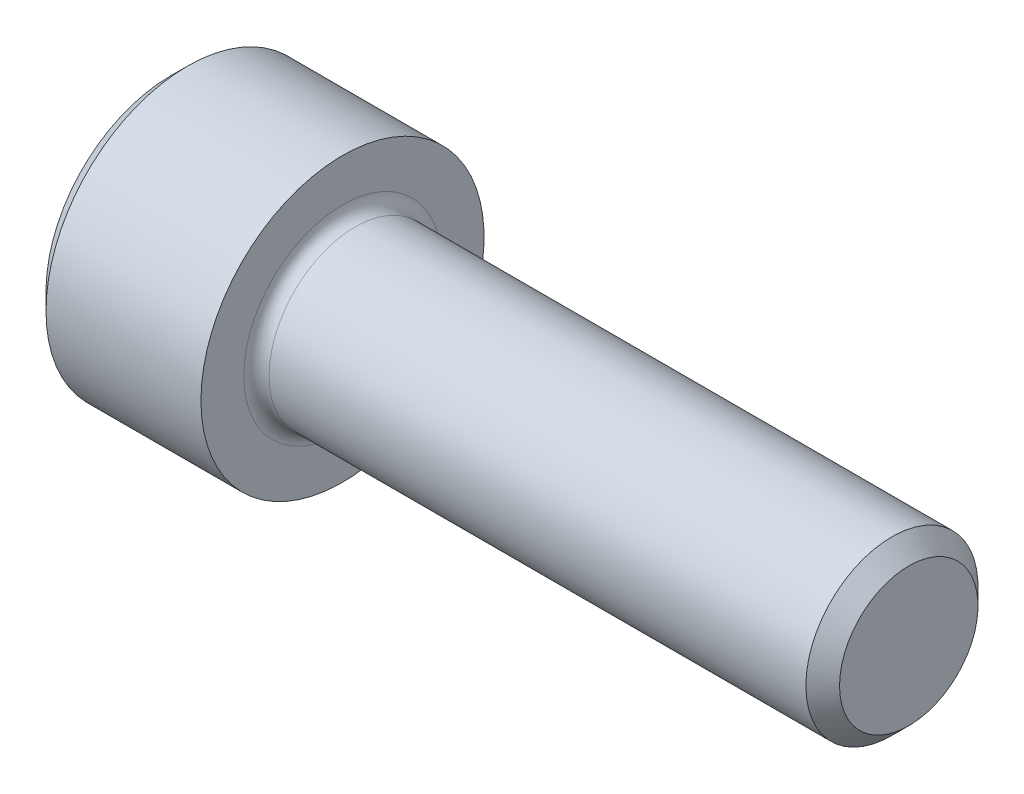
ISO-10303-21;
HEADER;
FILE_DESCRIPTION(('STEP AP214'),'2;1');
FILE_NAME('part.step','',(''),(''),'','','');
FILE_SCHEMA(('AUTOMOTIVE_DESIGN { 1 0 10303 214 1 1 1 1 }'));
ENDSEC;
DATA;
#1=APPLICATION_CONTEXT('core data for automotive mechanical design processes');
#2=APPLICATION_PROTOCOL_DEFINITION('international standard','automotive_design',2000,#1);
#3=PRODUCT_CONTEXT('',#1,'mechanical');
#4=PRODUCT('Part','Part','',(#3));
#5=PRODUCT_RELATED_PRODUCT_CATEGORY('part','',(#4));
#6=PRODUCT_DEFINITION_FORMATION('','',#4);
#7=PRODUCT_DEFINITION_CONTEXT('part definition',#1,'design');
#8=PRODUCT_DEFINITION('design','',#6,#7);
#9=PRODUCT_DEFINITION_SHAPE('','',#8);
#10=(LENGTH_UNIT() NAMED_UNIT(*) SI_UNIT(.MILLI.,.METRE.));
#11=(NAMED_UNIT(*) PLANE_ANGLE_UNIT() SI_UNIT($,.RADIAN.));
#12=(NAMED_UNIT(*) SI_UNIT($,.STERADIAN.) SOLID_ANGLE_UNIT());
#13=UNCERTAINTY_MEASURE_WITH_UNIT(LENGTH_MEASURE(1.E-05),#10,'distance_accuracy_value','');
#14=(GEOMETRIC_REPRESENTATION_CONTEXT(3) GLOBAL_UNCERTAINTY_ASSIGNED_CONTEXT((#13)) GLOBAL_UNIT_ASSIGNED_CONTEXT((#10,
#11,#12)) REPRESENTATION_CONTEXT('',''));
#15=CARTESIAN_POINT('',(0.,0.,0.));
#16=DIRECTION('',(0.,0.,1.));
#17=DIRECTION('',(1.,0.,0.));
#18=AXIS2_PLACEMENT_3D('',#15,#16,#17);
#19=CARTESIAN_POINT('',(2.286,1.14604605784411,1.98501));
#20=DIRECTION('',(-1.,0.,0.));
#21=DIRECTION('',(0.,0.,1.));
#22=AXIS2_PLACEMENT_3D('',#19,#20,#21);
#23=PLANE('',#22);
#24=DIRECTION('',(0.,0.500000000000001,0.866025403784438));
#25=VECTOR('',#24,1.);
#26=CARTESIAN_POINT('',(2.286,-1.71906908676614,0.992505));
#27=LINE('',#26,#25);
#28=CARTESIAN_POINT('',(2.2859999999804,-1.71906908679011,0.992505000013839));
#29=VERTEX_POINT('',#28);
#30=CARTESIAN_POINT('',(2.286,-1.14604605784409,1.98501));
#31=VERTEX_POINT('',#30);
#32=EDGE_CURVE('E101',#29,#31,#27,.T.);
#33=ORIENTED_EDGE('',*,*,#32,.T.);
#34=DIRECTION('',(0.,1.,0.));
#35=VECTOR('',#34,1.);
#36=CARTESIAN_POINT('',(2.286,1.14604605784411,1.98501));
#37=LINE('',#36,#35);
#38=CARTESIAN_POINT('',(2.28599999998701,0.,1.98501000001309));
#39=VERTEX_POINT('',#38);
#40=EDGE_CURVE('E96',#31,#39,#37,.T.);
#41=ORIENTED_EDGE('',*,*,#40,.T.);
#42=CARTESIAN_POINT('',(2.2859999999608,0.,0.));
#43=DIRECTION('',(-1.,0.,0.));
#44=DIRECTION('',(0.,0.,1.));
#45=AXIS2_PLACEMENT_3D('',#42,#43,#44);
#46=CIRCLE('',#45,1.98501000005535);
#47=EDGE_CURVE('E98',#39,#29,#46,.F.);
#48=ORIENTED_EDGE('',*,*,#47,.T.);
#49=EDGE_LOOP('',(#33,#41,#48));
#50=FACE_BOUND('',#49,.T.);
#51=ADVANCED_FACE('F17',(#50),#23,.T.);
#52=CARTESIAN_POINT('',(2.286,1.14604605784411,1.98501));
#53=DIRECTION('',(-1.,0.,0.));
#54=DIRECTION('',(0.,0.,1.));
#55=AXIS2_PLACEMENT_3D('',#52,#53,#54);
#56=PLANE('',#55);
#57=DIRECTION('',(0.,-0.499999999999998,0.86602540378444));
#58=VECTOR('',#57,1.);
#59=CARTESIAN_POINT('',(2.286,-1.71906908676615,-0.992504999999996));
#60=LINE('',#59,#58);
#61=CARTESIAN_POINT('',(2.2859999999804,-1.71906908679012,-0.992505000013836));
#62=VERTEX_POINT('',#61);
#63=CARTESIAN_POINT('',(2.286,-2.29209211568819,0.));
#64=VERTEX_POINT('',#63);
#65=EDGE_CURVE('E105',#62,#64,#60,.T.);
#66=ORIENTED_EDGE('',*,*,#65,.T.);
#67=DIRECTION('',(0.,0.500000000000001,0.866025403784438));
#68=VECTOR('',#67,1.);
#69=CARTESIAN_POINT('',(2.286,-2.29209211568819,0.));
#70=LINE('',#69,#68);
#71=EDGE_CURVE('E172',#64,#29,#70,.T.);
#72=ORIENTED_EDGE('',*,*,#71,.T.);
#73=CARTESIAN_POINT('',(2.2859999999608,0.,0.));
#74=DIRECTION('',(-1.,0.,0.));
#75=DIRECTION('',(0.,0.,1.));
#76=AXIS2_PLACEMENT_3D('',#73,#74,#75);
#77=CIRCLE('',#76,1.98501000005535);
#78=EDGE_CURVE('E117',#29,#62,#77,.F.);
#79=ORIENTED_EDGE('',*,*,#78,.T.);
#80=EDGE_LOOP('',(#66,#72,#79));
#81=FACE_BOUND('',#80,.T.);
#82=ADVANCED_FACE('F348',(#81),#56,.T.);
#83=CARTESIAN_POINT('',(2.286,1.14604605784411,1.98501));
#84=DIRECTION('',(-1.,0.,0.));
#85=DIRECTION('',(0.,0.,1.));
#86=AXIS2_PLACEMENT_3D('',#83,#84,#85);
#87=PLANE('',#86);
#88=DIRECTION('',(0.,1.,0.));
#89=VECTOR('',#88,1.);
#90=CARTESIAN_POINT('',(2.286,1.14604605784411,-1.98501));
#91=LINE('',#90,#89);
#92=CARTESIAN_POINT('',(2.28599999998701,0.,-1.98501000001309));
#93=VERTEX_POINT('',#92);
#94=CARTESIAN_POINT('',(2.286,-1.1460460578441,-1.98501));
#95=VERTEX_POINT('',#94);
#96=EDGE_CURVE('E167',#93,#95,#91,.F.);
#97=ORIENTED_EDGE('',*,*,#96,.T.);
#98=DIRECTION('',(0.,-0.499999999999999,0.866025403784439));
#99=VECTOR('',#98,1.);
#100=CARTESIAN_POINT('',(2.286,-1.1460460578441,-1.98501));
#101=LINE('',#100,#99);
#102=EDGE_CURVE('E162',#95,#62,#101,.T.);
#103=ORIENTED_EDGE('',*,*,#102,.T.);
#104=CARTESIAN_POINT('',(2.2859999999608,0.,0.));
#105=DIRECTION('',(-1.,0.,0.));
#106=DIRECTION('',(0.,0.,1.));
#107=AXIS2_PLACEMENT_3D('',#104,#105,#106);
#108=CIRCLE('',#107,1.98501000005535);
#109=EDGE_CURVE('E225',#62,#93,#108,.F.);
#110=ORIENTED_EDGE('',*,*,#109,.T.);
#111=EDGE_LOOP('',(#97,#103,#110));
#112=FACE_BOUND('',#111,.T.);
#113=ADVANCED_FACE('F345',(#112),#87,.T.);
#114=CARTESIAN_POINT('',(2.286,1.14604605784411,1.98501));
#115=DIRECTION('',(-1.,0.,0.));
#116=DIRECTION('',(0.,0.,1.));
#117=AXIS2_PLACEMENT_3D('',#114,#115,#116);
#118=PLANE('',#117);
#119=DIRECTION('',(0.,-0.500000000000001,-0.866025403784438));
#120=VECTOR('',#119,1.);
#121=CARTESIAN_POINT('',(2.286,1.71906908676615,-0.992505000000006));
#122=LINE('',#121,#120);
#123=CARTESIAN_POINT('',(2.2859999999804,1.71906908679012,-0.992505000013843));
#124=VERTEX_POINT('',#123);
#125=CARTESIAN_POINT('',(2.286,1.1460460578441,-1.98501));
#126=VERTEX_POINT('',#125);
#127=EDGE_CURVE('E157',#124,#126,#122,.T.);
#128=ORIENTED_EDGE('',*,*,#127,.T.);
#129=DIRECTION('',(0.,1.,0.));
#130=VECTOR('',#129,1.);
#131=CARTESIAN_POINT('',(2.286,1.14604605784411,-1.98501));
#132=LINE('',#131,#130);
#133=EDGE_CURVE('E152',#126,#93,#132,.F.);
#134=ORIENTED_EDGE('',*,*,#133,.T.);
#135=CARTESIAN_POINT('',(2.2859999999608,0.,0.));
#136=DIRECTION('',(-1.,0.,0.));
#137=DIRECTION('',(0.,0.,1.));
#138=AXIS2_PLACEMENT_3D('',#135,#136,#137);
#139=CIRCLE('',#138,1.98501000005535);
#140=EDGE_CURVE('E222',#93,#124,#139,.F.);
#141=ORIENTED_EDGE('',*,*,#140,.T.);
#142=EDGE_LOOP('',(#128,#134,#141));
#143=FACE_BOUND('',#142,.T.);
#144=ADVANCED_FACE('F341',(#143),#118,.T.);
#145=CARTESIAN_POINT('',(2.286,1.14604605784411,1.98501));
#146=DIRECTION('',(-1.,0.,0.));
#147=DIRECTION('',(0.,0.,1.));
#148=AXIS2_PLACEMENT_3D('',#145,#146,#147);
#149=PLANE('',#148);
#150=DIRECTION('',(0.,0.500000000000002,-0.866025403784437));
#151=VECTOR('',#150,1.);
#152=CARTESIAN_POINT('',(2.286,1.71906908676615,0.992504999999996));
#153=LINE('',#152,#151);
#154=CARTESIAN_POINT('',(2.2859999999804,1.71906908679012,0.992505000013835));
#155=VERTEX_POINT('',#154);
#156=CARTESIAN_POINT('',(2.286,2.2920921156882,0.));
#157=VERTEX_POINT('',#156);
#158=EDGE_CURVE('E147',#155,#157,#153,.T.);
#159=ORIENTED_EDGE('',*,*,#158,.T.);
#160=DIRECTION('',(0.,-0.500000000000002,-0.866025403784437));
#161=VECTOR('',#160,1.);
#162=CARTESIAN_POINT('',(2.286,2.2920921156882,0.));
#163=LINE('',#162,#161);
#164=EDGE_CURVE('E118',#157,#124,#163,.T.);
#165=ORIENTED_EDGE('',*,*,#164,.T.);
#166=CARTESIAN_POINT('',(2.2859999999608,0.,0.));
#167=DIRECTION('',(-1.,0.,0.));
#168=DIRECTION('',(0.,0.,1.));
#169=AXIS2_PLACEMENT_3D('',#166,#167,#168);
#170=CIRCLE('',#169,1.98501000005535);
#171=EDGE_CURVE('E125',#124,#155,#170,.F.);
#172=ORIENTED_EDGE('',*,*,#171,.T.);
#173=EDGE_LOOP('',(#159,#165,#172));
#174=FACE_BOUND('',#173,.T.);
#175=ADVANCED_FACE('F337',(#174),#149,.T.);
#176=CARTESIAN_POINT('',(2.28600000002643,0.,0.));
#177=DIRECTION('',(-1.,0.,0.));
#178=DIRECTION('',(0.,0.,1.));
#179=AXIS2_PLACEMENT_3D('',#176,#177,#178);
#180=CONICAL_SURFACE('',#179,1.98500999994167,1.04719755112655);
#181=CARTESIAN_POINT('',(3.43204605781011,0.,5.6843418860808E-11));
#182=VERTEX_POINT('',#181);
#183=VERTEX_LOOP('',#182);
#184=FACE_BOUND('',#183,.T.);
#185=ORIENTED_EDGE('',*,*,#47,.F.);
#186=CARTESIAN_POINT('',(2.2859999999608,0.,0.));
#187=DIRECTION('',(-1.,0.,0.));
#188=DIRECTION('',(0.,0.,1.));
#189=AXIS2_PLACEMENT_3D('',#186,#187,#188);
#190=CIRCLE('',#189,1.98501000005535);
#191=EDGE_CURVE('E113',#155,#39,#190,.F.);
#192=ORIENTED_EDGE('',*,*,#191,.F.);
#193=ORIENTED_EDGE('',*,*,#171,.F.);
#194=ORIENTED_EDGE('',*,*,#140,.F.);
#195=ORIENTED_EDGE('',*,*,#109,.F.);
#196=ORIENTED_EDGE('',*,*,#78,.F.);
#197=EDGE_LOOP('',(#185,#192,#193,#194,#195,#196));
#198=FACE_BOUND('',#197,.T.);
#199=ADVANCED_FACE('F111',(#184,#198),#180,.F.);
#200=CARTESIAN_POINT('',(2.286,1.14604605784411,1.98501));
#201=DIRECTION('',(-1.,0.,0.));
#202=DIRECTION('',(0.,0.,1.));
#203=AXIS2_PLACEMENT_3D('',#200,#201,#202);
#204=PLANE('',#203);
#205=DIRECTION('',(0.,-1.,0.));
#206=VECTOR('',#205,1.);
#207=CARTESIAN_POINT('',(2.286,-1.14604605784409,1.98501));
#208=LINE('',#207,#206);
#209=CARTESIAN_POINT('',(2.286,1.14604605784411,1.98501));
#210=VERTEX_POINT('',#209);
#211=EDGE_CURVE('E122',#39,#210,#208,.F.);
#212=ORIENTED_EDGE('',*,*,#211,.T.);
#213=DIRECTION('',(0.,0.499999999999998,-0.86602540378444));
#214=VECTOR('',#213,1.);
#215=CARTESIAN_POINT('',(2.286,2.2920921156882,0.));
#216=LINE('',#215,#214);
#217=EDGE_CURVE('E124',#155,#210,#216,.F.);
#218=ORIENTED_EDGE('',*,*,#217,.F.);
#219=ORIENTED_EDGE('',*,*,#191,.T.);
#220=EDGE_LOOP('',(#212,#218,#219));
#221=FACE_BOUND('',#220,.T.);
#222=ADVANCED_FACE('F121',(#221),#204,.T.);
#223=CARTESIAN_POINT('',(2.286,2.2920921156882,0.));
#224=DIRECTION('',(0.,-0.86602540378444,-0.499999999999998));
#225=DIRECTION('',(0.,0.499999999999998,-0.86602540378444));
#226=AXIS2_PLACEMENT_3D('',#223,#224,#225);
#227=PLANE('',#226);
#228=ORIENTED_EDGE('',*,*,#217,.T.);
#229=DIRECTION('',(1.,0.,0.));
#230=VECTOR('',#229,1.);
#231=CARTESIAN_POINT('',(2.286,1.14604605784411,1.98501));
#232=LINE('',#231,#230);
#233=CARTESIAN_POINT('',(0.,1.14604605784411,1.98501));
#234=VERTEX_POINT('',#233);
#235=EDGE_CURVE('E130',#210,#234,#232,.F.);
#236=ORIENTED_EDGE('',*,*,#235,.T.);
#237=DIRECTION('',(0.,-0.499999999999998,0.86602540378444));
#238=VECTOR('',#237,1.);
#239=CARTESIAN_POINT('',(0.,2.2920921156882,0.));
#240=LINE('',#239,#238);
#241=CARTESIAN_POINT('',(0.,2.2920921156882,0.));
#242=VERTEX_POINT('',#241);
#243=EDGE_CURVE('E137',#242,#234,#240,.T.);
#244=ORIENTED_EDGE('',*,*,#243,.F.);
#245=DIRECTION('',(1.,0.,0.));
#246=VECTOR('',#245,1.);
#247=CARTESIAN_POINT('',(2.286,2.2920921156882,0.));
#248=LINE('',#247,#246);
#249=EDGE_CURVE('E187',#242,#157,#248,.T.);
#250=ORIENTED_EDGE('',*,*,#249,.T.);
#251=ORIENTED_EDGE('',*,*,#158,.F.);
#252=EDGE_LOOP('',(#228,#236,#244,#250,#251));
#253=FACE_BOUND('',#252,.T.);
#254=ADVANCED_FACE('F329',(#253),#227,.T.);
#255=CARTESIAN_POINT('',(2.286,-1.14604605784409,1.98501));
#256=DIRECTION('',(0.,0.,1.));
#257=DIRECTION('',(0.,-1.,0.));
#258=AXIS2_PLACEMENT_3D('',#255,#256,#257);
#259=PLANE('',#258);
#260=ORIENTED_EDGE('',*,*,#235,.F.);
#261=ORIENTED_EDGE('',*,*,#211,.F.);
#262=ORIENTED_EDGE('',*,*,#40,.F.);
#263=DIRECTION('',(1.,0.,0.));
#264=VECTOR('',#263,1.);
#265=CARTESIAN_POINT('',(2.286,-1.14604605784409,1.98501));
#266=LINE('',#265,#264);
#267=CARTESIAN_POINT('',(0.,-1.14604605784409,1.98501));
#268=VERTEX_POINT('',#267);
#269=EDGE_CURVE('E132',#268,#31,#266,.T.);
#270=ORIENTED_EDGE('',*,*,#269,.F.);
#271=DIRECTION('',(0.,1.,0.));
#272=VECTOR('',#271,1.);
#273=CARTESIAN_POINT('',(0.,0.,1.98501));
#274=LINE('',#273,#272);
#275=EDGE_CURVE('E363',#234,#268,#274,.F.);
#276=ORIENTED_EDGE('',*,*,#275,.F.);
#277=EDGE_LOOP('',(#260,#261,#262,#270,#276));
#278=FACE_BOUND('',#277,.T.);
#279=ADVANCED_FACE('F128',(#278),#259,.F.);
#280=CARTESIAN_POINT('',(2.286,-1.14604605784409,1.98501));
#281=DIRECTION('',(0.,0.866025403784438,-0.500000000000001));
#282=DIRECTION('',(0.,0.500000000000001,0.866025403784438));
#283=AXIS2_PLACEMENT_3D('',#280,#281,#282);
#284=PLANE('',#283);
#285=ORIENTED_EDGE('',*,*,#71,.F.);
#286=DIRECTION('',(1.,0.,0.));
#287=VECTOR('',#286,1.);
#288=CARTESIAN_POINT('',(2.286,-2.29209211568819,0.));
#289=LINE('',#288,#287);
#290=CARTESIAN_POINT('',(0.,-2.29209211568819,0.));
#291=VERTEX_POINT('',#290);
#292=EDGE_CURVE('E198',#291,#64,#289,.T.);
#293=ORIENTED_EDGE('',*,*,#292,.F.);
#294=DIRECTION('',(0.,-0.500000000000001,-0.866025403784438));
#295=VECTOR('',#294,1.);
#296=CARTESIAN_POINT('',(0.,-1.14604605784409,1.98501));
#297=LINE('',#296,#295);
#298=EDGE_CURVE('E361',#268,#291,#297,.T.);
#299=ORIENTED_EDGE('',*,*,#298,.F.);
#300=ORIENTED_EDGE('',*,*,#269,.T.);
#301=ORIENTED_EDGE('',*,*,#32,.F.);
#302=EDGE_LOOP('',(#285,#293,#299,#300,#301));
#303=FACE_BOUND('',#302,.T.);
#304=ADVANCED_FACE('F322',(#303),#284,.T.);
#305=CARTESIAN_POINT('',(2.286,-2.29209211568819,0.));
#306=DIRECTION('',(0.,0.866025403784439,0.499999999999999));
#307=DIRECTION('',(0.,-0.499999999999999,0.866025403784439));
#308=AXIS2_PLACEMENT_3D('',#305,#306,#307);
#309=PLANE('',#308);
#310=ORIENTED_EDGE('',*,*,#102,.F.);
#311=DIRECTION('',(1.,0.,0.));
#312=VECTOR('',#311,1.);
#313=CARTESIAN_POINT('',(2.286,-1.1460460578441,-1.98501));
#314=LINE('',#313,#312);
#315=CARTESIAN_POINT('',(0.,-1.1460460578441,-1.98501));
#316=VERTEX_POINT('',#315);
#317=EDGE_CURVE('E191',#95,#316,#314,.F.);
#318=ORIENTED_EDGE('',*,*,#317,.T.);
#319=DIRECTION('',(0.,0.499999999999999,-0.86602540378444));
#320=VECTOR('',#319,1.);
#321=CARTESIAN_POINT('',(0.,-2.29209211568819,0.));
#322=LINE('',#321,#320);
#323=EDGE_CURVE('E358',#291,#316,#322,.T.);
#324=ORIENTED_EDGE('',*,*,#323,.F.);
#325=ORIENTED_EDGE('',*,*,#292,.T.);
#326=ORIENTED_EDGE('',*,*,#65,.F.);
#327=EDGE_LOOP('',(#310,#318,#324,#325,#326));
#328=FACE_BOUND('',#327,.T.);
#329=ADVANCED_FACE('F318',(#328),#309,.T.);
#330=CARTESIAN_POINT('',(2.286,1.1460460578441,-1.98501));
#331=DIRECTION('',(0.,0.,-1.));
#332=DIRECTION('',(0.,1.,0.));
#333=AXIS2_PLACEMENT_3D('',#330,#331,#332);
#334=PLANE('',#333);
#335=ORIENTED_EDGE('',*,*,#317,.F.);
#336=ORIENTED_EDGE('',*,*,#96,.F.);
#337=ORIENTED_EDGE('',*,*,#133,.F.);
#338=DIRECTION('',(1.,0.,0.));
#339=VECTOR('',#338,1.);
#340=CARTESIAN_POINT('',(2.286,1.1460460578441,-1.98501));
#341=LINE('',#340,#339);
#342=CARTESIAN_POINT('',(0.,1.1460460578441,-1.98501));
#343=VERTEX_POINT('',#342);
#344=EDGE_CURVE('E190',#126,#343,#341,.F.);
#345=ORIENTED_EDGE('',*,*,#344,.T.);
#346=DIRECTION('',(0.,1.,0.));
#347=VECTOR('',#346,1.);
#348=CARTESIAN_POINT('',(0.,0.,-1.98501));
#349=LINE('',#348,#347);
#350=EDGE_CURVE('E373',#316,#343,#349,.T.);
#351=ORIENTED_EDGE('',*,*,#350,.F.);
#352=EDGE_LOOP('',(#335,#336,#337,#345,#351));
#353=FACE_BOUND('',#352,.T.);
#354=ADVANCED_FACE('F314',(#353),#334,.F.);
#355=CARTESIAN_POINT('',(2.286,2.2920921156882,0.));
#356=DIRECTION('',(0.,0.866025403784438,-0.500000000000002));
#357=DIRECTION('',(0.,0.500000000000002,0.866025403784438));
#358=AXIS2_PLACEMENT_3D('',#355,#356,#357);
#359=PLANE('',#358);
#360=ORIENTED_EDGE('',*,*,#344,.F.);
#361=ORIENTED_EDGE('',*,*,#127,.F.);
#362=ORIENTED_EDGE('',*,*,#164,.F.);
#363=ORIENTED_EDGE('',*,*,#249,.F.);
#364=DIRECTION('',(0.,0.500000000000002,0.866025403784438));
#365=VECTOR('',#364,1.);
#366=CARTESIAN_POINT('',(0.,1.1460460578441,-1.98501));
#367=LINE('',#366,#365);
#368=EDGE_CURVE('E218',#343,#242,#367,.T.);
#369=ORIENTED_EDGE('',*,*,#368,.F.);
#370=EDGE_LOOP('',(#360,#361,#362,#363,#369));
#371=FACE_BOUND('',#370,.T.);
#372=ADVANCED_FACE('F310',(#371),#359,.F.);
#373=CARTESIAN_POINT('',(0.,0.,0.));
#374=DIRECTION('',(-1.,0.,0.));
#375=DIRECTION('',(0.,0.,1.));
#376=AXIS2_PLACEMENT_3D('',#373,#374,#375);
#377=PLANE('',#376);
#378=CARTESIAN_POINT('',(-5.6843418860808E-11,0.,0.));
#379=DIRECTION('',(1.,0.,0.));
#380=DIRECTION('',(0.,1.,0.));
#381=AXIS2_PLACEMENT_3D('',#378,#379,#380);
#382=CIRCLE('',#381,3.48615000001473);
#383=CARTESIAN_POINT('',(-5.68434426698877E-11,3.48615000001473,0.));
#384=VERTEX_POINT('',#383);
#385=EDGE_CURVE('E216',#384,#384,#382,.T.);
#386=ORIENTED_EDGE('',*,*,#385,.F.);
#387=EDGE_LOOP('',(#386));
#388=FACE_BOUND('',#387,.T.);
#389=ORIENTED_EDGE('',*,*,#350,.T.);
#390=ORIENTED_EDGE('',*,*,#368,.T.);
#391=ORIENTED_EDGE('',*,*,#243,.T.);
#392=ORIENTED_EDGE('',*,*,#275,.T.);
#393=ORIENTED_EDGE('',*,*,#298,.T.);
#394=ORIENTED_EDGE('',*,*,#323,.T.);
#395=EDGE_LOOP('',(#389,#390,#391,#392,#393,#394));
#396=FACE_BOUND('',#395,.T.);
#397=ADVANCED_FACE('F302',(#388,#396),#377,.T.);
#398=CARTESIAN_POINT('',(0.482599999998001,0.,0.));
#399=DIRECTION('',(1.,0.,0.));
#400=DIRECTION('',(0.,1.,0.));
#401=AXIS2_PLACEMENT_3D('',#398,#399,#400);
#402=CONICAL_SURFACE('',#401,3.96875000006958,0.785398163397448);
#403=ORIENTED_EDGE('',*,*,#385,.T.);
#404=EDGE_LOOP('',(#403));
#405=FACE_BOUND('',#404,.T.);
#406=CARTESIAN_POINT('',(0.4826,0.,0.));
#407=DIRECTION('',(-1.,0.,0.));
#408=DIRECTION('',(0.,0.,1.));
#409=AXIS2_PLACEMENT_3D('',#406,#407,#408);
#410=CIRCLE('',#409,3.96875);
#411=CARTESIAN_POINT('',(0.4826,0.,3.96875));
#412=VERTEX_POINT('',#411);
#413=EDGE_CURVE('E215',#412,#412,#410,.F.);
#414=ORIENTED_EDGE('',*,*,#413,.F.);
#415=EDGE_LOOP('',(#414));
#416=FACE_BOUND('',#415,.T.);
#417=ADVANCED_FACE('F297',(#405,#416),#402,.T.);
#418=CARTESIAN_POINT('',(-31.75,0.,0.));
#419=DIRECTION('',(-1.,0.,0.));
#420=DIRECTION('',(0.,0.,1.));
#421=AXIS2_PLACEMENT_3D('',#418,#419,#420);
#422=CYLINDRICAL_SURFACE('',#421,3.96875);
#423=CARTESIAN_POINT('',(4.826,0.,0.));
#424=DIRECTION('',(-1.,0.,0.));
#425=DIRECTION('',(0.,0.,1.));
#426=AXIS2_PLACEMENT_3D('',#423,#424,#425);
#427=CIRCLE('',#426,3.96875);
#428=CARTESIAN_POINT('',(4.826,0.,3.96875));
#429=VERTEX_POINT('',#428);
#430=EDGE_CURVE('E212',#429,#429,#427,.F.);
#431=ORIENTED_EDGE('',*,*,#430,.F.);
#432=EDGE_LOOP('',(#431));
#433=FACE_BOUND('',#432,.T.);
#434=ORIENTED_EDGE('',*,*,#413,.T.);
#435=EDGE_LOOP('',(#434));
#436=FACE_BOUND('',#435,.T.);
#437=ADVANCED_FACE('F293',(#433,#436),#422,.T.);
#438=CARTESIAN_POINT('',(20.701,1.94056,0.));
#439=DIRECTION('',(1.,0.,0.));
#440=DIRECTION('',(0.,0.,-1.));
#441=AXIS2_PLACEMENT_3D('',#438,#439,#440);
#442=PLANE('',#441);
#443=CARTESIAN_POINT('',(20.7009999999741,0.,0.));
#444=DIRECTION('',(-1.,0.,0.));
#445=DIRECTION('',(0.,0.,1.));
#446=AXIS2_PLACEMENT_3D('',#443,#444,#445);
#447=CIRCLE('',#446,1.94056000003684);
#448=CARTESIAN_POINT('',(20.7009999999741,0.,1.94056000003684));
#449=VERTEX_POINT('',#448);
#450=EDGE_CURVE('E208',#449,#449,#447,.T.);
#451=ORIENTED_EDGE('',*,*,#450,.F.);
#452=EDGE_LOOP('',(#451));
#453=FACE_BOUND('',#452,.T.);
#454=ADVANCED_FACE('F251',(#453),#442,.T.);
#455=CARTESIAN_POINT('',(4.826,3.96875,0.));
#456=DIRECTION('',(1.,0.,0.));
#457=DIRECTION('',(0.,0.,-1.));
#458=AXIS2_PLACEMENT_3D('',#455,#456,#457);
#459=PLANE('',#458);
#460=ORIENTED_EDGE('',*,*,#430,.T.);
#461=EDGE_LOOP('',(#460));
#462=FACE_BOUND('',#461,.T.);
#463=CARTESIAN_POINT('',(4.826,0.,0.));
#464=DIRECTION('',(1.,0.,0.));
#465=DIRECTION('',(0.,0.,1.));
#466=AXIS2_PLACEMENT_3D('',#463,#464,#465);
#467=CIRCLE('',#466,2.76859999999999);
#468=CARTESIAN_POINT('',(4.826,0.,-2.76859999999999));
#469=VERTEX_POINT('',#468);
#470=CARTESIAN_POINT('',(4.826,0.,2.76859999999999));
#471=VERTEX_POINT('',#470);
#472=EDGE_CURVE('E211',#469,#471,#467,.F.);
#473=ORIENTED_EDGE('',*,*,#472,.T.);
#474=CARTESIAN_POINT('',(4.826,0.,0.));
#475=DIRECTION('',(1.,0.,0.));
#476=DIRECTION('',(0.,0.,-1.));
#477=AXIS2_PLACEMENT_3D('',#474,#475,#476);
#478=CIRCLE('',#477,2.76859999999999);
#479=EDGE_CURVE('E36',#471,#469,#478,.F.);
#480=ORIENTED_EDGE('',*,*,#479,.T.);
#481=EDGE_LOOP('',(#473,#480));
#482=FACE_BOUND('',#481,.T.);
#483=ADVANCED_FACE('F232',(#462,#482),#459,.T.);
#484=CARTESIAN_POINT('',(20.2285600000778,0.,0.));
#485=DIRECTION('',(-1.,0.,0.));
#486=DIRECTION('',(0.,0.,1.));
#487=AXIS2_PLACEMENT_3D('',#484,#485,#486);
#488=CONICAL_SURFACE('',#487,2.41299999987632,0.785398163337289);
#489=CARTESIAN_POINT('',(20.22856,0.,0.));
#490=DIRECTION('',(-1.,0.,0.));
#491=DIRECTION('',(0.,0.,1.));
#492=AXIS2_PLACEMENT_3D('',#489,#490,#491);
#493=CIRCLE('',#492,2.41299999999999);
#494=CARTESIAN_POINT('',(20.22856,0.,2.41299999999999));
#495=VERTEX_POINT('',#494);
#496=EDGE_CURVE('E28',#495,#495,#493,.T.);
#497=ORIENTED_EDGE('',*,*,#496,.F.);
#498=EDGE_LOOP('',(#497));
#499=FACE_BOUND('',#498,.T.);
#500=ORIENTED_EDGE('',*,*,#450,.T.);
#501=EDGE_LOOP('',(#500));
#502=FACE_BOUND('',#501,.T.);
#503=ADVANCED_FACE('F250',(#499,#502),#488,.T.);
#504=CARTESIAN_POINT('',(5.1816,0.,0.));
#505=DIRECTION('',(1.,0.,0.));
#506=DIRECTION('',(0.,0.,-1.));
#507=AXIS2_PLACEMENT_3D('',#504,#505,#506);
#508=TOROIDAL_SURFACE('',#507,2.76859999999999,0.3556);
#509=CARTESIAN_POINT('',(5.1816,0.,0.));
#510=DIRECTION('',(-1.,0.,0.));
#511=DIRECTION('',(0.,0.,1.));
#512=AXIS2_PLACEMENT_3D('',#509,#510,#511);
#513=CIRCLE('',#512,2.41299999999999);
#514=CARTESIAN_POINT('',(5.1816,0.,2.41299999999999));
#515=VERTEX_POINT('',#514);
#516=EDGE_CURVE('E11',#515,#515,#513,.F.);
#517=ORIENTED_EDGE('',*,*,#516,.F.);
#518=EDGE_LOOP('',(#517));
#519=FACE_BOUND('',#518,.T.);
#520=ORIENTED_EDGE('',*,*,#472,.F.);
#521=ORIENTED_EDGE('',*,*,#479,.F.);
#522=EDGE_LOOP('',(#520,#521));
#523=FACE_BOUND('',#522,.T.);
#524=ADVANCED_FACE('F229',(#519,#523),#508,.F.);
#525=CARTESIAN_POINT('',(-31.75,0.,0.));
#526=DIRECTION('',(-1.,0.,0.));
#527=DIRECTION('',(0.,0.,1.));
#528=AXIS2_PLACEMENT_3D('',#525,#526,#527);
#529=CYLINDRICAL_SURFACE('',#528,2.41299999999999);
#530=ORIENTED_EDGE('',*,*,#516,.T.);
#531=EDGE_LOOP('',(#530));
#532=FACE_BOUND('',#531,.T.);
#533=ORIENTED_EDGE('',*,*,#496,.T.);
#534=EDGE_LOOP('',(#533));
#535=FACE_BOUND('',#534,.T.);
#536=ADVANCED_FACE('F275',(#532,#535),#529,.T.);
#537=CLOSED_SHELL('',(#51,#82,#113,#144,#175,#199,#222,#254,#279,#304,#329,#354,#372,#397,#417,
#437,#454,#483,#503,#524,#536));
#538=MANIFOLD_SOLID_BREP('B1',#537);
#539=ADVANCED_BREP_SHAPE_REPRESENTATION('',(#18,#538),#14);
#540=SHAPE_DEFINITION_REPRESENTATION(#9,#539);
ENDSEC;
END-ISO-10303-21;
